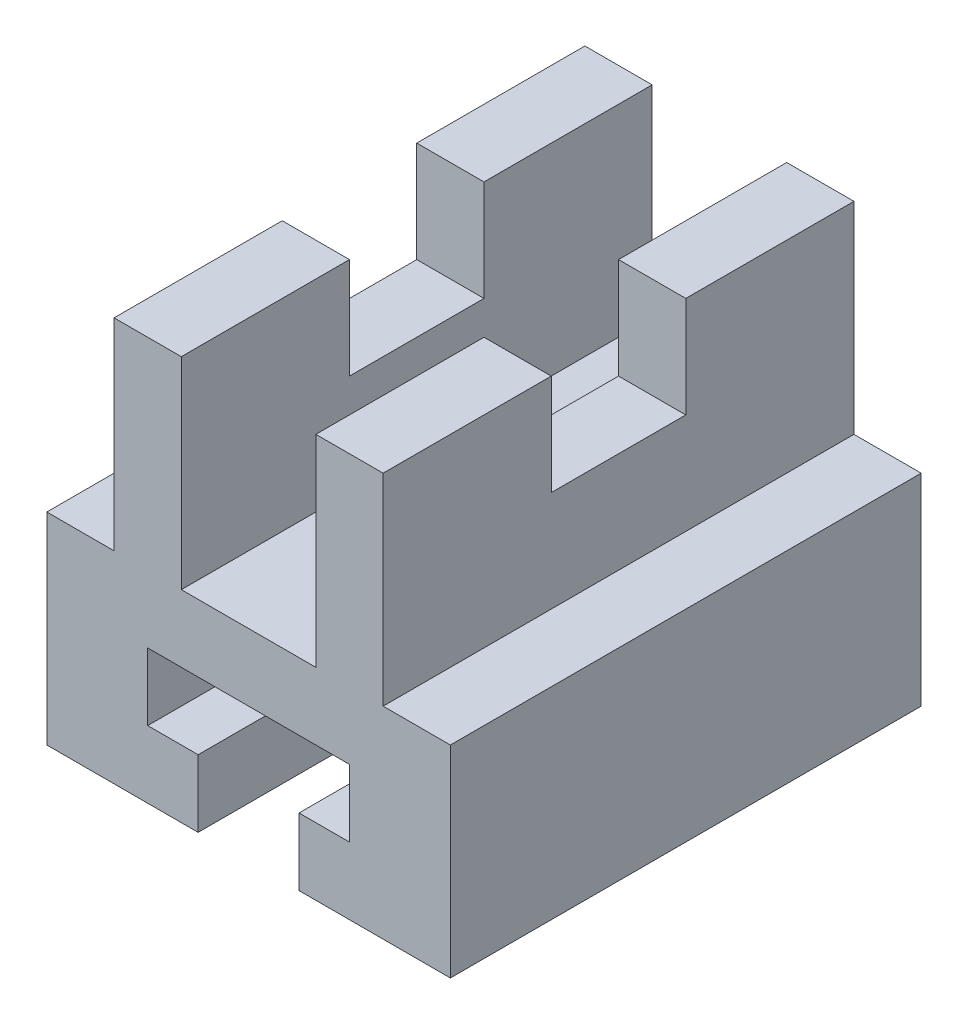
ISO-10303-21;
HEADER;
FILE_DESCRIPTION(('STEP AP214'),'2;1');
FILE_NAME('part.step','',(''),(''),'','','');
FILE_SCHEMA(('AUTOMOTIVE_DESIGN { 1 0 10303 214 1 1 1 1 }'));
ENDSEC;
DATA;
#1=APPLICATION_CONTEXT('core data for automotive mechanical design processes');
#2=APPLICATION_PROTOCOL_DEFINITION('international standard','automotive_design',2000,#1);
#3=PRODUCT_CONTEXT('',#1,'mechanical');
#4=PRODUCT('Part','Part','',(#3));
#5=PRODUCT_RELATED_PRODUCT_CATEGORY('part','',(#4));
#6=PRODUCT_DEFINITION_FORMATION('','',#4);
#7=PRODUCT_DEFINITION_CONTEXT('part definition',#1,'design');
#8=PRODUCT_DEFINITION('design','',#6,#7);
#9=PRODUCT_DEFINITION_SHAPE('','',#8);
#10=(LENGTH_UNIT() NAMED_UNIT(*) SI_UNIT(.MILLI.,.METRE.));
#11=(NAMED_UNIT(*) PLANE_ANGLE_UNIT() SI_UNIT($,.RADIAN.));
#12=(NAMED_UNIT(*) SI_UNIT($,.STERADIAN.) SOLID_ANGLE_UNIT());
#13=UNCERTAINTY_MEASURE_WITH_UNIT(LENGTH_MEASURE(1.E-05),#10,'distance_accuracy_value','');
#14=(GEOMETRIC_REPRESENTATION_CONTEXT(3) GLOBAL_UNCERTAINTY_ASSIGNED_CONTEXT((#13)) GLOBAL_UNIT_ASSIGNED_CONTEXT((#10,
#11,#12)) REPRESENTATION_CONTEXT('',''));
#15=CARTESIAN_POINT('',(0.,0.,0.));
#16=DIRECTION('',(0.,0.,1.));
#17=DIRECTION('',(1.,0.,0.));
#18=AXIS2_PLACEMENT_3D('',#15,#16,#17);
#19=CARTESIAN_POINT('',(-35.6353607965203,25.3072625698324,70.));
#20=DIRECTION('',(0.,-1.,0.));
#21=DIRECTION('',(1.,0.,0.));
#22=AXIS2_PLACEMENT_3D('',#19,#20,#21);
#23=PLANE('',#22);
#24=DIRECTION('',(0.,0.,1.));
#25=VECTOR('',#24,1.);
#26=CARTESIAN_POINT('',(14.3646392034797,25.3072625698324,0.));
#27=LINE('',#26,#25);
#28=CARTESIAN_POINT('',(14.3646392034797,25.3072625698324,45.));
#29=VERTEX_POINT('',#28);
#30=CARTESIAN_POINT('',(14.3646392034797,25.3072625698324,70.));
#31=VERTEX_POINT('',#30);
#32=EDGE_CURVE('E242',#29,#31,#27,.T.);
#33=ORIENTED_EDGE('',*,*,#32,.F.);
#34=DIRECTION('',(-1.,0.,0.));
#35=VECTOR('',#34,1.);
#36=CARTESIAN_POINT('',(14.3646392034797,25.3072625698324,45.));
#37=LINE('',#36,#35);
#38=CARTESIAN_POINT('',(4.36463920347973,25.3072625698324,45.));
#39=VERTEX_POINT('',#38);
#40=EDGE_CURVE('E360',#29,#39,#37,.T.);
#41=ORIENTED_EDGE('',*,*,#40,.T.);
#42=DIRECTION('',(0.,0.,1.));
#43=VECTOR('',#42,1.);
#44=CARTESIAN_POINT('',(4.36463920347973,25.3072625698324,0.));
#45=LINE('',#44,#43);
#46=CARTESIAN_POINT('',(4.36463920347973,25.3072625698324,70.));
#47=VERTEX_POINT('',#46);
#48=EDGE_CURVE('E392',#39,#47,#45,.T.);
#49=ORIENTED_EDGE('',*,*,#48,.T.);
#50=DIRECTION('',(-1.,0.,0.));
#51=VECTOR('',#50,1.);
#52=CARTESIAN_POINT('',(-35.6353607965203,25.3072625698324,70.));
#53=LINE('',#52,#51);
#54=EDGE_CURVE('E319',#31,#47,#53,.T.);
#55=ORIENTED_EDGE('',*,*,#54,.F.);
#56=EDGE_LOOP('',(#33,#41,#49,#55));
#57=FACE_BOUND('',#56,.T.);
#58=ADVANCED_FACE('F33',(#57),#23,.F.);
#59=DIRECTION('',(0.,0.,1.));
#60=VECTOR('',#59,1.);
#61=CARTESIAN_POINT('',(-15.6353607965203,25.3072625698324,0.));
#62=LINE('',#61,#60);
#63=CARTESIAN_POINT('',(-15.6353607965203,25.3072625698324,45.));
#64=VERTEX_POINT('',#63);
#65=CARTESIAN_POINT('',(-15.6353607965203,25.3072625698324,70.));
#66=VERTEX_POINT('',#65);
#67=EDGE_CURVE('E382',#64,#66,#62,.T.);
#68=ORIENTED_EDGE('',*,*,#67,.F.);
#69=CARTESIAN_POINT('',(-25.6353607965203,25.3072625698324,45.));
#70=VERTEX_POINT('',#69);
#71=EDGE_CURVE('E357',#64,#70,#37,.T.);
#72=ORIENTED_EDGE('',*,*,#71,.T.);
#73=DIRECTION('',(0.,0.,1.));
#74=VECTOR('',#73,1.);
#75=CARTESIAN_POINT('',(-25.6353607965203,25.3072625698324,0.));
#76=LINE('',#75,#74);
#77=CARTESIAN_POINT('',(-25.6353607965203,25.3072625698324,70.));
#78=VERTEX_POINT('',#77);
#79=EDGE_CURVE('E415',#70,#78,#76,.T.);
#80=ORIENTED_EDGE('',*,*,#79,.T.);
#81=EDGE_CURVE('E318',#66,#78,#53,.T.);
#82=ORIENTED_EDGE('',*,*,#81,.F.);
#83=EDGE_LOOP('',(#68,#72,#80,#82));
#84=FACE_BOUND('',#83,.T.);
#85=ADVANCED_FACE('F465',(#84),#23,.F.);
#86=CARTESIAN_POINT('',(4.36463920347973,25.3072625698324,0.));
#87=VERTEX_POINT('',#86);
#88=CARTESIAN_POINT('',(4.36463920347973,25.3072625698324,25.));
#89=VERTEX_POINT('',#88);
#90=EDGE_CURVE('E234',#87,#89,#45,.T.);
#91=ORIENTED_EDGE('',*,*,#90,.T.);
#92=DIRECTION('',(-1.,0.,0.));
#93=VECTOR('',#92,1.);
#94=CARTESIAN_POINT('',(14.3646392034797,25.3072625698324,25.));
#95=LINE('',#94,#93);
#96=CARTESIAN_POINT('',(14.3646392034797,25.3072625698324,25.));
#97=VERTEX_POINT('',#96);
#98=EDGE_CURVE('E48',#97,#89,#95,.T.);
#99=ORIENTED_EDGE('',*,*,#98,.F.);
#100=CARTESIAN_POINT('',(14.3646392034797,25.3072625698324,0.));
#101=VERTEX_POINT('',#100);
#102=EDGE_CURVE('E232',#101,#97,#27,.T.);
#103=ORIENTED_EDGE('',*,*,#102,.F.);
#104=DIRECTION('',(-1.,0.,0.));
#105=VECTOR('',#104,1.);
#106=CARTESIAN_POINT('',(-35.6353607965203,25.3072625698324,0.));
#107=LINE('',#106,#105);
#108=EDGE_CURVE('E311',#101,#87,#107,.T.);
#109=ORIENTED_EDGE('',*,*,#108,.T.);
#110=EDGE_LOOP('',(#91,#99,#103,#109));
#111=FACE_BOUND('',#110,.T.);
#112=ADVANCED_FACE('F230',(#111),#23,.F.);
#113=CARTESIAN_POINT('',(-35.6353607965203,-34.6927374301676,70.));
#114=DIRECTION('',(0.,1.,0.));
#115=DIRECTION('',(0.,0.,1.));
#116=AXIS2_PLACEMENT_3D('',#113,#114,#115);
#117=PLANE('',#116);
#118=DIRECTION('',(1.,0.,0.));
#119=VECTOR('',#118,1.);
#120=CARTESIAN_POINT('',(-35.6353607965203,-34.6927374301676,0.));
#121=LINE('',#120,#119);
#122=CARTESIAN_POINT('',(-35.6353607965203,-34.6927374301676,0.));
#123=VERTEX_POINT('',#122);
#124=CARTESIAN_POINT('',(-13.1353607965203,-34.6927374301676,0.));
#125=VERTEX_POINT('',#124);
#126=EDGE_CURVE('E325',#123,#125,#121,.T.);
#127=ORIENTED_EDGE('',*,*,#126,.T.);
#128=DIRECTION('',(0.,0.,1.));
#129=VECTOR('',#128,1.);
#130=CARTESIAN_POINT('',(-13.1353607965203,-34.6927374301676,0.));
#131=LINE('',#130,#129);
#132=CARTESIAN_POINT('',(-13.1353607965203,-34.6927374301676,70.));
#133=VERTEX_POINT('',#132);
#134=EDGE_CURVE('E291',#125,#133,#131,.T.);
#135=ORIENTED_EDGE('',*,*,#134,.T.);
#136=DIRECTION('',(1.,0.,0.));
#137=VECTOR('',#136,1.);
#138=CARTESIAN_POINT('',(-35.6353607965203,-34.6927374301676,70.));
#139=LINE('',#138,#137);
#140=CARTESIAN_POINT('',(-35.6353607965203,-34.6927374301676,70.));
#141=VERTEX_POINT('',#140);
#142=EDGE_CURVE('E312',#141,#133,#139,.T.);
#143=ORIENTED_EDGE('',*,*,#142,.F.);
#144=DIRECTION('',(0.,0.,-1.));
#145=VECTOR('',#144,1.);
#146=CARTESIAN_POINT('',(-35.6353607965203,-34.6927374301676,70.));
#147=LINE('',#146,#145);
#148=EDGE_CURVE('E335',#141,#123,#147,.T.);
#149=ORIENTED_EDGE('',*,*,#148,.T.);
#150=EDGE_LOOP('',(#127,#135,#143,#149));
#151=FACE_BOUND('',#150,.T.);
#152=ADVANCED_FACE('F483',(#151),#117,.F.);
#153=CARTESIAN_POINT('',(-35.6353607965203,25.3072625698324,70.));
#154=DIRECTION('',(1.,0.,0.));
#155=DIRECTION('',(0.,0.,-1.));
#156=AXIS2_PLACEMENT_3D('',#153,#154,#155);
#157=PLANE('',#156);
#158=DIRECTION('',(0.,-1.,0.));
#159=VECTOR('',#158,1.);
#160=CARTESIAN_POINT('',(-35.6353607965203,25.3072625698324,70.));
#161=LINE('',#160,#159);
#162=CARTESIAN_POINT('',(-35.6353607965203,-4.69273743016759,70.));
#163=VERTEX_POINT('',#162);
#164=EDGE_CURVE('E308',#163,#141,#161,.T.);
#165=ORIENTED_EDGE('',*,*,#164,.F.);
#166=DIRECTION('',(0.,0.,1.));
#167=VECTOR('',#166,1.);
#168=CARTESIAN_POINT('',(-35.6353607965203,-4.69273743016759,0.));
#169=LINE('',#168,#167);
#170=CARTESIAN_POINT('',(-35.6353607965203,-4.69273743016759,0.));
#171=VERTEX_POINT('',#170);
#172=EDGE_CURVE('E406',#171,#163,#169,.T.);
#173=ORIENTED_EDGE('',*,*,#172,.F.);
#174=DIRECTION('',(0.,-1.,0.));
#175=VECTOR('',#174,1.);
#176=CARTESIAN_POINT('',(-35.6353607965203,25.3072625698324,0.));
#177=LINE('',#176,#175);
#178=EDGE_CURVE('E294',#171,#123,#177,.T.);
#179=ORIENTED_EDGE('',*,*,#178,.T.);
#180=ORIENTED_EDGE('',*,*,#148,.F.);
#181=EDGE_LOOP('',(#165,#173,#179,#180));
#182=FACE_BOUND('',#181,.T.);
#183=ADVANCED_FACE('F35',(#182),#157,.F.);
#184=CARTESIAN_POINT('',(1.86463920347972,-34.6927374301676,70.));
#185=VERTEX_POINT('',#184);
#186=CARTESIAN_POINT('',(24.3646392034797,-34.6927374301676,70.));
#187=VERTEX_POINT('',#186);
#188=EDGE_CURVE('E310',#185,#187,#139,.T.);
#189=ORIENTED_EDGE('',*,*,#188,.F.);
#190=DIRECTION('',(0.,0.,1.));
#191=VECTOR('',#190,1.);
#192=CARTESIAN_POINT('',(1.86463920347972,-34.6927374301676,0.));
#193=LINE('',#192,#191);
#194=CARTESIAN_POINT('',(1.86463920347972,-34.6927374301676,0.));
#195=VERTEX_POINT('',#194);
#196=EDGE_CURVE('E271',#195,#185,#193,.T.);
#197=ORIENTED_EDGE('',*,*,#196,.F.);
#198=CARTESIAN_POINT('',(24.3646392034797,-34.6927374301676,0.));
#199=VERTEX_POINT('',#198);
#200=EDGE_CURVE('E324',#195,#199,#121,.T.);
#201=ORIENTED_EDGE('',*,*,#200,.T.);
#202=DIRECTION('',(0.,0.,-1.));
#203=VECTOR('',#202,1.);
#204=CARTESIAN_POINT('',(24.3646392034797,-34.6927374301676,70.));
#205=LINE('',#204,#203);
#206=EDGE_CURVE('E322',#187,#199,#205,.T.);
#207=ORIENTED_EDGE('',*,*,#206,.F.);
#208=EDGE_LOOP('',(#189,#197,#201,#207));
#209=FACE_BOUND('',#208,.T.);
#210=ADVANCED_FACE('F442',(#209),#117,.F.);
#211=CARTESIAN_POINT('',(24.3646392034797,25.3072625698324,70.));
#212=DIRECTION('',(-1.,0.,0.));
#213=DIRECTION('',(0.,0.,1.));
#214=AXIS2_PLACEMENT_3D('',#211,#212,#213);
#215=PLANE('',#214);
#216=DIRECTION('',(0.,1.,0.));
#217=VECTOR('',#216,1.);
#218=CARTESIAN_POINT('',(24.3646392034797,25.3072625698324,0.));
#219=LINE('',#218,#217);
#220=CARTESIAN_POINT('',(24.3646392034797,-4.69273743016759,0.));
#221=VERTEX_POINT('',#220);
#222=EDGE_CURVE('E328',#199,#221,#219,.T.);
#223=ORIENTED_EDGE('',*,*,#222,.T.);
#224=DIRECTION('',(0.,0.,1.));
#225=VECTOR('',#224,1.);
#226=CARTESIAN_POINT('',(24.3646392034797,-4.69273743016759,0.));
#227=LINE('',#226,#225);
#228=CARTESIAN_POINT('',(24.3646392034797,-4.69273743016759,70.));
#229=VERTEX_POINT('',#228);
#230=EDGE_CURVE('E244',#221,#229,#227,.T.);
#231=ORIENTED_EDGE('',*,*,#230,.T.);
#232=DIRECTION('',(0.,1.,0.));
#233=VECTOR('',#232,1.);
#234=CARTESIAN_POINT('',(24.3646392034797,25.3072625698324,70.));
#235=LINE('',#234,#233);
#236=EDGE_CURVE('E315',#187,#229,#235,.T.);
#237=ORIENTED_EDGE('',*,*,#236,.F.);
#238=ORIENTED_EDGE('',*,*,#206,.T.);
#239=EDGE_LOOP('',(#223,#231,#237,#238));
#240=FACE_BOUND('',#239,.T.);
#241=ADVANCED_FACE('F428',(#240),#215,.F.);
#242=CARTESIAN_POINT('',(-25.6353607965203,25.3072625698324,0.));
#243=VERTEX_POINT('',#242);
#244=CARTESIAN_POINT('',(-25.6353607965203,25.3072625698324,25.));
#245=VERTEX_POINT('',#244);
#246=EDGE_CURVE('E411',#243,#245,#76,.T.);
#247=ORIENTED_EDGE('',*,*,#246,.T.);
#248=CARTESIAN_POINT('',(-15.6353607965203,25.3072625698324,25.));
#249=VERTEX_POINT('',#248);
#250=EDGE_CURVE('E235',#249,#245,#95,.T.);
#251=ORIENTED_EDGE('',*,*,#250,.F.);
#252=CARTESIAN_POINT('',(-15.6353607965203,25.3072625698324,0.));
#253=VERTEX_POINT('',#252);
#254=EDGE_CURVE('E397',#253,#249,#62,.T.);
#255=ORIENTED_EDGE('',*,*,#254,.F.);
#256=EDGE_CURVE('E331',#253,#243,#107,.T.);
#257=ORIENTED_EDGE('',*,*,#256,.T.);
#258=EDGE_LOOP('',(#247,#251,#255,#257));
#259=FACE_BOUND('',#258,.T.);
#260=ADVANCED_FACE('F512',(#259),#23,.F.);
#261=CARTESIAN_POINT('',(0.,0.,70.));
#262=DIRECTION('',(0.,0.,1.));
#263=DIRECTION('',(1.,0.,0.));
#264=AXIS2_PLACEMENT_3D('',#261,#262,#263);
#265=PLANE('',#264);
#266=DIRECTION('',(0.,1.,0.));
#267=VECTOR('',#266,1.);
#268=CARTESIAN_POINT('',(4.36463920347973,-4.6927374301676,70.));
#269=LINE('',#268,#267);
#270=CARTESIAN_POINT('',(4.36463920347973,-4.6927374301676,70.));
#271=VERTEX_POINT('',#270);
#272=EDGE_CURVE('E376',#271,#47,#269,.T.);
#273=ORIENTED_EDGE('',*,*,#272,.F.);
#274=DIRECTION('',(1.,0.,0.));
#275=VECTOR('',#274,1.);
#276=CARTESIAN_POINT('',(-15.6353607965203,-4.6927374301676,70.));
#277=LINE('',#276,#275);
#278=CARTESIAN_POINT('',(-15.6353607965203,-4.6927374301676,70.));
#279=VERTEX_POINT('',#278);
#280=EDGE_CURVE('E385',#279,#271,#277,.T.);
#281=ORIENTED_EDGE('',*,*,#280,.F.);
#282=DIRECTION('',(0.,-1.,0.));
#283=VECTOR('',#282,1.);
#284=CARTESIAN_POINT('',(-15.6353607965203,25.3072625698324,70.));
#285=LINE('',#284,#283);
#286=EDGE_CURVE('E371',#66,#279,#285,.T.);
#287=ORIENTED_EDGE('',*,*,#286,.F.);
#288=ORIENTED_EDGE('',*,*,#81,.T.);
#289=DIRECTION('',(0.,1.,0.));
#290=VECTOR('',#289,1.);
#291=CARTESIAN_POINT('',(-25.6353607965203,-4.69273743016759,70.));
#292=LINE('',#291,#290);
#293=CARTESIAN_POINT('',(-25.6353607965203,-4.69273743016759,70.));
#294=VERTEX_POINT('',#293);
#295=EDGE_CURVE('E403',#294,#78,#292,.T.);
#296=ORIENTED_EDGE('',*,*,#295,.F.);
#297=DIRECTION('',(1.,0.,0.));
#298=VECTOR('',#297,1.);
#299=CARTESIAN_POINT('',(-35.6353607965203,-4.69273743016759,70.));
#300=LINE('',#299,#298);
#301=EDGE_CURVE('E391',#163,#294,#300,.T.);
#302=ORIENTED_EDGE('',*,*,#301,.F.);
#303=ORIENTED_EDGE('',*,*,#164,.T.);
#304=ORIENTED_EDGE('',*,*,#142,.T.);
#305=DIRECTION('',(0.,-1.,0.));
#306=VECTOR('',#305,1.);
#307=CARTESIAN_POINT('',(-13.1353607965203,-34.6927374301676,70.));
#308=LINE('',#307,#306);
#309=CARTESIAN_POINT('',(-13.1353607965203,-24.6927374301676,70.));
#310=VERTEX_POINT('',#309);
#311=EDGE_CURVE('E253',#310,#133,#308,.T.);
#312=ORIENTED_EDGE('',*,*,#311,.F.);
#313=DIRECTION('',(1.,0.,0.));
#314=VECTOR('',#313,1.);
#315=CARTESIAN_POINT('',(-13.1353607965203,-24.6927374301676,70.));
#316=LINE('',#315,#314);
#317=CARTESIAN_POINT('',(-20.6353607965203,-24.6927374301676,70.));
#318=VERTEX_POINT('',#317);
#319=EDGE_CURVE('E287',#318,#310,#316,.T.);
#320=ORIENTED_EDGE('',*,*,#319,.F.);
#321=DIRECTION('',(0.,-1.,0.));
#322=VECTOR('',#321,1.);
#323=CARTESIAN_POINT('',(-20.6353607965203,-24.6927374301676,70.));
#324=LINE('',#323,#322);
#325=CARTESIAN_POINT('',(-20.6353607965203,-14.6927374301676,70.));
#326=VERTEX_POINT('',#325);
#327=EDGE_CURVE('E284',#326,#318,#324,.T.);
#328=ORIENTED_EDGE('',*,*,#327,.F.);
#329=DIRECTION('',(-1.,0.,0.));
#330=VECTOR('',#329,1.);
#331=CARTESIAN_POINT('',(-20.6353607965203,-14.6927374301676,70.));
#332=LINE('',#331,#330);
#333=CARTESIAN_POINT('',(9.36463920347972,-14.6927374301676,70.));
#334=VERTEX_POINT('',#333);
#335=EDGE_CURVE('E281',#334,#326,#332,.T.);
#336=ORIENTED_EDGE('',*,*,#335,.F.);
#337=DIRECTION('',(0.,1.,0.));
#338=VECTOR('',#337,1.);
#339=CARTESIAN_POINT('',(9.36463920347972,-14.6927374301676,70.));
#340=LINE('',#339,#338);
#341=CARTESIAN_POINT('',(9.36463920347972,-24.6927374301676,70.));
#342=VERTEX_POINT('',#341);
#343=EDGE_CURVE('E278',#342,#334,#340,.T.);
#344=ORIENTED_EDGE('',*,*,#343,.F.);
#345=DIRECTION('',(1.,0.,0.));
#346=VECTOR('',#345,1.);
#347=CARTESIAN_POINT('',(9.36463920347972,-24.6927374301676,70.));
#348=LINE('',#347,#346);
#349=CARTESIAN_POINT('',(1.86463920347972,-24.6927374301676,70.));
#350=VERTEX_POINT('',#349);
#351=EDGE_CURVE('E275',#350,#342,#348,.T.);
#352=ORIENTED_EDGE('',*,*,#351,.F.);
#353=DIRECTION('',(0.,1.,0.));
#354=VECTOR('',#353,1.);
#355=CARTESIAN_POINT('',(1.86463920347972,-24.6927374301676,70.));
#356=LINE('',#355,#354);
#357=EDGE_CURVE('E272',#185,#350,#356,.T.);
#358=ORIENTED_EDGE('',*,*,#357,.F.);
#359=ORIENTED_EDGE('',*,*,#188,.T.);
#360=ORIENTED_EDGE('',*,*,#236,.T.);
#361=DIRECTION('',(1.,0.,0.));
#362=VECTOR('',#361,1.);
#363=CARTESIAN_POINT('',(24.3646392034797,-4.69273743016759,70.));
#364=LINE('',#363,#362);
#365=CARTESIAN_POINT('',(14.3646392034797,-4.69273743016759,70.));
#366=VERTEX_POINT('',#365);
#367=EDGE_CURVE('E420',#366,#229,#364,.T.);
#368=ORIENTED_EDGE('',*,*,#367,.F.);
#369=DIRECTION('',(0.,-1.,0.));
#370=VECTOR('',#369,1.);
#371=CARTESIAN_POINT('',(14.3646392034797,-4.69273743016759,70.));
#372=LINE('',#371,#370);
#373=EDGE_CURVE('E414',#31,#366,#372,.T.);
#374=ORIENTED_EDGE('',*,*,#373,.F.);
#375=ORIENTED_EDGE('',*,*,#54,.T.);
#376=EDGE_LOOP('',(#273,#281,#287,#288,#296,#302,#303,#304,#312,#320,#328,#336,#344,#352,#358,
#359,#360,#368,#374,#375));
#377=FACE_BOUND('',#376,.T.);
#378=ADVANCED_FACE('F434',(#377),#265,.T.);
#379=CARTESIAN_POINT('',(0.,0.,0.));
#380=DIRECTION('',(0.,0.,1.));
#381=DIRECTION('',(1.,0.,0.));
#382=AXIS2_PLACEMENT_3D('',#379,#380,#381);
#383=PLANE('',#382);
#384=DIRECTION('',(1.,0.,0.));
#385=VECTOR('',#384,1.);
#386=CARTESIAN_POINT('',(-15.6353607965203,-4.6927374301676,0.));
#387=LINE('',#386,#385);
#388=CARTESIAN_POINT('',(-15.6353607965203,-4.6927374301676,0.));
#389=VERTEX_POINT('',#388);
#390=CARTESIAN_POINT('',(4.36463920347973,-4.6927374301676,0.));
#391=VERTEX_POINT('',#390);
#392=EDGE_CURVE('E375',#389,#391,#387,.T.);
#393=ORIENTED_EDGE('',*,*,#392,.T.);
#394=DIRECTION('',(0.,1.,0.));
#395=VECTOR('',#394,1.);
#396=CARTESIAN_POINT('',(4.36463920347973,-4.6927374301676,0.));
#397=LINE('',#396,#395);
#398=EDGE_CURVE('E379',#391,#87,#397,.T.);
#399=ORIENTED_EDGE('',*,*,#398,.T.);
#400=ORIENTED_EDGE('',*,*,#108,.F.);
#401=DIRECTION('',(0.,-1.,0.));
#402=VECTOR('',#401,1.);
#403=CARTESIAN_POINT('',(14.3646392034797,-4.69273743016759,0.));
#404=LINE('',#403,#402);
#405=CARTESIAN_POINT('',(14.3646392034797,-4.69273743016759,0.));
#406=VERTEX_POINT('',#405);
#407=EDGE_CURVE('E240',#101,#406,#404,.T.);
#408=ORIENTED_EDGE('',*,*,#407,.T.);
#409=DIRECTION('',(1.,0.,0.));
#410=VECTOR('',#409,1.);
#411=CARTESIAN_POINT('',(24.3646392034797,-4.69273743016759,0.));
#412=LINE('',#411,#410);
#413=EDGE_CURVE('E246',#406,#221,#412,.T.);
#414=ORIENTED_EDGE('',*,*,#413,.T.);
#415=ORIENTED_EDGE('',*,*,#222,.F.);
#416=ORIENTED_EDGE('',*,*,#200,.F.);
#417=DIRECTION('',(0.,1.,0.));
#418=VECTOR('',#417,1.);
#419=CARTESIAN_POINT('',(1.86463920347972,-24.6927374301676,0.));
#420=LINE('',#419,#418);
#421=CARTESIAN_POINT('',(1.86463920347972,-24.6927374301676,0.));
#422=VERTEX_POINT('',#421);
#423=EDGE_CURVE('E249',#195,#422,#420,.T.);
#424=ORIENTED_EDGE('',*,*,#423,.T.);
#425=DIRECTION('',(1.,0.,0.));
#426=VECTOR('',#425,1.);
#427=CARTESIAN_POINT('',(9.36463920347972,-24.6927374301676,0.));
#428=LINE('',#427,#426);
#429=CARTESIAN_POINT('',(9.36463920347972,-24.6927374301676,0.));
#430=VERTEX_POINT('',#429);
#431=EDGE_CURVE('E252',#422,#430,#428,.T.);
#432=ORIENTED_EDGE('',*,*,#431,.T.);
#433=DIRECTION('',(0.,1.,0.));
#434=VECTOR('',#433,1.);
#435=CARTESIAN_POINT('',(9.36463920347972,-14.6927374301676,0.));
#436=LINE('',#435,#434);
#437=CARTESIAN_POINT('',(9.36463920347972,-14.6927374301676,0.));
#438=VERTEX_POINT('',#437);
#439=EDGE_CURVE('E256',#430,#438,#436,.T.);
#440=ORIENTED_EDGE('',*,*,#439,.T.);
#441=DIRECTION('',(-1.,0.,0.));
#442=VECTOR('',#441,1.);
#443=CARTESIAN_POINT('',(-20.6353607965203,-14.6927374301676,0.));
#444=LINE('',#443,#442);
#445=CARTESIAN_POINT('',(-20.6353607965203,-14.6927374301676,0.));
#446=VERTEX_POINT('',#445);
#447=EDGE_CURVE('E259',#438,#446,#444,.T.);
#448=ORIENTED_EDGE('',*,*,#447,.T.);
#449=DIRECTION('',(0.,-1.,0.));
#450=VECTOR('',#449,1.);
#451=CARTESIAN_POINT('',(-20.6353607965203,-24.6927374301676,0.));
#452=LINE('',#451,#450);
#453=CARTESIAN_POINT('',(-20.6353607965203,-24.6927374301676,0.));
#454=VERTEX_POINT('',#453);
#455=EDGE_CURVE('E262',#446,#454,#452,.T.);
#456=ORIENTED_EDGE('',*,*,#455,.T.);
#457=DIRECTION('',(1.,0.,0.));
#458=VECTOR('',#457,1.);
#459=CARTESIAN_POINT('',(-13.1353607965203,-24.6927374301676,0.));
#460=LINE('',#459,#458);
#461=CARTESIAN_POINT('',(-13.1353607965203,-24.6927374301676,0.));
#462=VERTEX_POINT('',#461);
#463=EDGE_CURVE('E265',#454,#462,#460,.T.);
#464=ORIENTED_EDGE('',*,*,#463,.T.);
#465=DIRECTION('',(0.,-1.,0.));
#466=VECTOR('',#465,1.);
#467=CARTESIAN_POINT('',(-13.1353607965203,-34.6927374301676,0.));
#468=LINE('',#467,#466);
#469=EDGE_CURVE('E268',#462,#125,#468,.T.);
#470=ORIENTED_EDGE('',*,*,#469,.T.);
#471=ORIENTED_EDGE('',*,*,#126,.F.);
#472=ORIENTED_EDGE('',*,*,#178,.F.);
#473=DIRECTION('',(1.,0.,0.));
#474=VECTOR('',#473,1.);
#475=CARTESIAN_POINT('',(-35.6353607965203,-4.69273743016759,0.));
#476=LINE('',#475,#474);
#477=CARTESIAN_POINT('',(-25.6353607965203,-4.69273743016759,0.));
#478=VERTEX_POINT('',#477);
#479=EDGE_CURVE('E399',#171,#478,#476,.T.);
#480=ORIENTED_EDGE('',*,*,#479,.T.);
#481=DIRECTION('',(0.,1.,0.));
#482=VECTOR('',#481,1.);
#483=CARTESIAN_POINT('',(-25.6353607965203,-4.69273743016759,0.));
#484=LINE('',#483,#482);
#485=EDGE_CURVE('E402',#478,#243,#484,.T.);
#486=ORIENTED_EDGE('',*,*,#485,.T.);
#487=ORIENTED_EDGE('',*,*,#256,.F.);
#488=DIRECTION('',(0.,-1.,0.));
#489=VECTOR('',#488,1.);
#490=CARTESIAN_POINT('',(-15.6353607965203,25.3072625698324,0.));
#491=LINE('',#490,#489);
#492=EDGE_CURVE('E372',#253,#389,#491,.T.);
#493=ORIENTED_EDGE('',*,*,#492,.T.);
#494=EDGE_LOOP('',(#393,#399,#400,#408,#414,#415,#416,#424,#432,#440,#448,#456,#464,#470,#471,
#472,#480,#486,#487,#493));
#495=FACE_BOUND('',#494,.T.);
#496=ADVANCED_FACE('F445',(#495),#383,.F.);
#497=CARTESIAN_POINT('',(-13.1353607965203,-34.6927374301676,0.));
#498=DIRECTION('',(-1.,0.,0.));
#499=DIRECTION('',(0.,0.,1.));
#500=AXIS2_PLACEMENT_3D('',#497,#498,#499);
#501=PLANE('',#500);
#502=ORIENTED_EDGE('',*,*,#311,.T.);
#503=ORIENTED_EDGE('',*,*,#134,.F.);
#504=ORIENTED_EDGE('',*,*,#469,.F.);
#505=DIRECTION('',(0.,0.,1.));
#506=VECTOR('',#505,1.);
#507=CARTESIAN_POINT('',(-13.1353607965203,-24.6927374301676,0.));
#508=LINE('',#507,#506);
#509=EDGE_CURVE('E295',#462,#310,#508,.T.);
#510=ORIENTED_EDGE('',*,*,#509,.T.);
#511=EDGE_LOOP('',(#502,#503,#504,#510));
#512=FACE_BOUND('',#511,.T.);
#513=ADVANCED_FACE('F488',(#512),#501,.F.);
#514=CARTESIAN_POINT('',(-13.1353607965203,-24.6927374301676,0.));
#515=DIRECTION('',(0.,-1.,0.));
#516=DIRECTION('',(0.,0.,-1.));
#517=AXIS2_PLACEMENT_3D('',#514,#515,#516);
#518=PLANE('',#517);
#519=ORIENTED_EDGE('',*,*,#319,.T.);
#520=ORIENTED_EDGE('',*,*,#509,.F.);
#521=ORIENTED_EDGE('',*,*,#463,.F.);
#522=DIRECTION('',(0.,0.,1.));
#523=VECTOR('',#522,1.);
#524=CARTESIAN_POINT('',(-20.6353607965203,-24.6927374301676,0.));
#525=LINE('',#524,#523);
#526=EDGE_CURVE('E297',#454,#318,#525,.T.);
#527=ORIENTED_EDGE('',*,*,#526,.T.);
#528=EDGE_LOOP('',(#519,#520,#521,#527));
#529=FACE_BOUND('',#528,.T.);
#530=ADVANCED_FACE('F492',(#529),#518,.F.);
#531=CARTESIAN_POINT('',(-20.6353607965203,-24.6927374301676,0.));
#532=DIRECTION('',(-1.,0.,0.));
#533=DIRECTION('',(0.,0.,1.));
#534=AXIS2_PLACEMENT_3D('',#531,#532,#533);
#535=PLANE('',#534);
#536=ORIENTED_EDGE('',*,*,#327,.T.);
#537=ORIENTED_EDGE('',*,*,#526,.F.);
#538=ORIENTED_EDGE('',*,*,#455,.F.);
#539=DIRECTION('',(0.,0.,1.));
#540=VECTOR('',#539,1.);
#541=CARTESIAN_POINT('',(-20.6353607965203,-14.6927374301676,0.));
#542=LINE('',#541,#540);
#543=EDGE_CURVE('E299',#446,#326,#542,.T.);
#544=ORIENTED_EDGE('',*,*,#543,.T.);
#545=EDGE_LOOP('',(#536,#537,#538,#544));
#546=FACE_BOUND('',#545,.T.);
#547=ADVANCED_FACE('F495',(#546),#535,.F.);
#548=CARTESIAN_POINT('',(-20.6353607965203,-14.6927374301676,0.));
#549=DIRECTION('',(0.,1.,0.));
#550=DIRECTION('',(0.,0.,1.));
#551=AXIS2_PLACEMENT_3D('',#548,#549,#550);
#552=PLANE('',#551);
#553=ORIENTED_EDGE('',*,*,#335,.T.);
#554=ORIENTED_EDGE('',*,*,#543,.F.);
#555=ORIENTED_EDGE('',*,*,#447,.F.);
#556=DIRECTION('',(0.,0.,1.));
#557=VECTOR('',#556,1.);
#558=CARTESIAN_POINT('',(9.36463920347972,-14.6927374301676,0.));
#559=LINE('',#558,#557);
#560=EDGE_CURVE('E301',#438,#334,#559,.T.);
#561=ORIENTED_EDGE('',*,*,#560,.T.);
#562=EDGE_LOOP('',(#553,#554,#555,#561));
#563=FACE_BOUND('',#562,.T.);
#564=ADVANCED_FACE('F499',(#563),#552,.F.);
#565=CARTESIAN_POINT('',(9.36463920347972,-14.6927374301676,0.));
#566=DIRECTION('',(1.,0.,0.));
#567=DIRECTION('',(0.,0.,-1.));
#568=AXIS2_PLACEMENT_3D('',#565,#566,#567);
#569=PLANE('',#568);
#570=ORIENTED_EDGE('',*,*,#343,.T.);
#571=ORIENTED_EDGE('',*,*,#560,.F.);
#572=ORIENTED_EDGE('',*,*,#439,.F.);
#573=DIRECTION('',(0.,0.,1.));
#574=VECTOR('',#573,1.);
#575=CARTESIAN_POINT('',(9.36463920347972,-24.6927374301676,0.));
#576=LINE('',#575,#574);
#577=EDGE_CURVE('E303',#430,#342,#576,.T.);
#578=ORIENTED_EDGE('',*,*,#577,.T.);
#579=EDGE_LOOP('',(#570,#571,#572,#578));
#580=FACE_BOUND('',#579,.T.);
#581=ADVANCED_FACE('F503',(#580),#569,.F.);
#582=CARTESIAN_POINT('',(9.36463920347972,-24.6927374301676,0.));
#583=DIRECTION('',(0.,-1.,0.));
#584=DIRECTION('',(0.,0.,-1.));
#585=AXIS2_PLACEMENT_3D('',#582,#583,#584);
#586=PLANE('',#585);
#587=ORIENTED_EDGE('',*,*,#351,.T.);
#588=ORIENTED_EDGE('',*,*,#577,.F.);
#589=ORIENTED_EDGE('',*,*,#431,.F.);
#590=DIRECTION('',(0.,0.,1.));
#591=VECTOR('',#590,1.);
#592=CARTESIAN_POINT('',(1.86463920347972,-24.6927374301676,0.));
#593=LINE('',#592,#591);
#594=EDGE_CURVE('E305',#422,#350,#593,.T.);
#595=ORIENTED_EDGE('',*,*,#594,.T.);
#596=EDGE_LOOP('',(#587,#588,#589,#595));
#597=FACE_BOUND('',#596,.T.);
#598=ADVANCED_FACE('F505',(#597),#586,.F.);
#599=CARTESIAN_POINT('',(1.86463920347972,-24.6927374301676,0.));
#600=DIRECTION('',(1.,0.,0.));
#601=DIRECTION('',(0.,0.,-1.));
#602=AXIS2_PLACEMENT_3D('',#599,#600,#601);
#603=PLANE('',#602);
#604=ORIENTED_EDGE('',*,*,#357,.T.);
#605=ORIENTED_EDGE('',*,*,#594,.F.);
#606=ORIENTED_EDGE('',*,*,#423,.F.);
#607=ORIENTED_EDGE('',*,*,#196,.T.);
#608=EDGE_LOOP('',(#604,#605,#606,#607));
#609=FACE_BOUND('',#608,.T.);
#610=ADVANCED_FACE('F508',(#609),#603,.F.);
#611=CARTESIAN_POINT('',(24.3646392034797,-4.69273743016759,0.));
#612=DIRECTION('',(0.,-1.,0.));
#613=DIRECTION('',(0.,0.,-1.));
#614=AXIS2_PLACEMENT_3D('',#611,#612,#613);
#615=PLANE('',#614);
#616=ORIENTED_EDGE('',*,*,#367,.T.);
#617=ORIENTED_EDGE('',*,*,#230,.F.);
#618=ORIENTED_EDGE('',*,*,#413,.F.);
#619=DIRECTION('',(0.,0.,1.));
#620=VECTOR('',#619,1.);
#621=CARTESIAN_POINT('',(14.3646392034797,-4.69273743016759,0.));
#622=LINE('',#621,#620);
#623=EDGE_CURVE('E241',#406,#366,#622,.T.);
#624=ORIENTED_EDGE('',*,*,#623,.T.);
#625=EDGE_LOOP('',(#616,#617,#618,#624));
#626=FACE_BOUND('',#625,.T.);
#627=ADVANCED_FACE('F446',(#626),#615,.F.);
#628=CARTESIAN_POINT('',(14.3646392034797,-4.69273743016759,0.));
#629=DIRECTION('',(-1.,0.,0.));
#630=DIRECTION('',(0.,0.,1.));
#631=AXIS2_PLACEMENT_3D('',#628,#629,#630);
#632=PLANE('',#631);
#633=DIRECTION('',(0.,0.,1.));
#634=VECTOR('',#633,1.);
#635=CARTESIAN_POINT('',(14.3646392034797,10.3072625698324,25.));
#636=LINE('',#635,#634);
#637=CARTESIAN_POINT('',(14.3646392034797,10.3072625698324,25.));
#638=VERTEX_POINT('',#637);
#639=CARTESIAN_POINT('',(14.3646392034797,10.3072625698324,45.));
#640=VERTEX_POINT('',#639);
#641=EDGE_CURVE('E224',#638,#640,#636,.T.);
#642=ORIENTED_EDGE('',*,*,#641,.T.);
#643=DIRECTION('',(0.,1.,0.));
#644=VECTOR('',#643,1.);
#645=CARTESIAN_POINT('',(14.3646392034797,10.3072625698324,45.));
#646=LINE('',#645,#644);
#647=EDGE_CURVE('E519',#640,#29,#646,.T.);
#648=ORIENTED_EDGE('',*,*,#647,.T.);
#649=ORIENTED_EDGE('',*,*,#32,.T.);
#650=ORIENTED_EDGE('',*,*,#373,.T.);
#651=ORIENTED_EDGE('',*,*,#623,.F.);
#652=ORIENTED_EDGE('',*,*,#407,.F.);
#653=ORIENTED_EDGE('',*,*,#102,.T.);
#654=DIRECTION('',(0.,-1.,0.));
#655=VECTOR('',#654,1.);
#656=CARTESIAN_POINT('',(14.3646392034797,25.3072625698324,25.));
#657=LINE('',#656,#655);
#658=EDGE_CURVE('E216',#97,#638,#657,.T.);
#659=ORIENTED_EDGE('',*,*,#658,.T.);
#660=EDGE_LOOP('',(#642,#648,#649,#650,#651,#652,#653,#659));
#661=FACE_BOUND('',#660,.T.);
#662=ADVANCED_FACE('F237',(#661),#632,.F.);
#663=CARTESIAN_POINT('',(-25.6353607965203,-4.69273743016759,0.));
#664=DIRECTION('',(1.,0.,0.));
#665=DIRECTION('',(0.,0.,-1.));
#666=AXIS2_PLACEMENT_3D('',#663,#664,#665);
#667=PLANE('',#666);
#668=ORIENTED_EDGE('',*,*,#79,.F.);
#669=DIRECTION('',(0.,1.,0.));
#670=VECTOR('',#669,1.);
#671=CARTESIAN_POINT('',(-25.6353607965203,10.3072625698324,45.));
#672=LINE('',#671,#670);
#673=CARTESIAN_POINT('',(-25.6353607965203,10.3072625698324,45.));
#674=VERTEX_POINT('',#673);
#675=EDGE_CURVE('E225',#674,#70,#672,.T.);
#676=ORIENTED_EDGE('',*,*,#675,.F.);
#677=DIRECTION('',(0.,0.,1.));
#678=VECTOR('',#677,1.);
#679=CARTESIAN_POINT('',(-25.6353607965203,10.3072625698324,25.));
#680=LINE('',#679,#678);
#681=CARTESIAN_POINT('',(-25.6353607965203,10.3072625698324,25.));
#682=VERTEX_POINT('',#681);
#683=EDGE_CURVE('E351',#682,#674,#680,.T.);
#684=ORIENTED_EDGE('',*,*,#683,.F.);
#685=DIRECTION('',(0.,-1.,0.));
#686=VECTOR('',#685,1.);
#687=CARTESIAN_POINT('',(-25.6353607965203,25.3072625698324,25.));
#688=LINE('',#687,#686);
#689=EDGE_CURVE('E515',#245,#682,#688,.T.);
#690=ORIENTED_EDGE('',*,*,#689,.F.);
#691=ORIENTED_EDGE('',*,*,#246,.F.);
#692=ORIENTED_EDGE('',*,*,#485,.F.);
#693=DIRECTION('',(0.,0.,1.));
#694=VECTOR('',#693,1.);
#695=CARTESIAN_POINT('',(-25.6353607965203,-4.69273743016759,0.));
#696=LINE('',#695,#694);
#697=EDGE_CURVE('E416',#478,#294,#696,.T.);
#698=ORIENTED_EDGE('',*,*,#697,.T.);
#699=ORIENTED_EDGE('',*,*,#295,.T.);
#700=EDGE_LOOP('',(#668,#676,#684,#690,#691,#692,#698,#699));
#701=FACE_BOUND('',#700,.T.);
#702=ADVANCED_FACE('F470',(#701),#667,.F.);
#703=CARTESIAN_POINT('',(-35.6353607965203,-4.69273743016759,0.));
#704=DIRECTION('',(0.,-1.,0.));
#705=DIRECTION('',(0.,0.,-1.));
#706=AXIS2_PLACEMENT_3D('',#703,#704,#705);
#707=PLANE('',#706);
#708=ORIENTED_EDGE('',*,*,#301,.T.);
#709=ORIENTED_EDGE('',*,*,#697,.F.);
#710=ORIENTED_EDGE('',*,*,#479,.F.);
#711=ORIENTED_EDGE('',*,*,#172,.T.);
#712=EDGE_LOOP('',(#708,#709,#710,#711));
#713=FACE_BOUND('',#712,.T.);
#714=ADVANCED_FACE('F474',(#713),#707,.F.);
#715=CARTESIAN_POINT('',(4.36463920347973,-4.6927374301676,0.));
#716=DIRECTION('',(1.,0.,0.));
#717=DIRECTION('',(0.,0.,-1.));
#718=AXIS2_PLACEMENT_3D('',#715,#716,#717);
#719=PLANE('',#718);
#720=ORIENTED_EDGE('',*,*,#48,.F.);
#721=DIRECTION('',(0.,-1.,0.));
#722=VECTOR('',#721,1.);
#723=CARTESIAN_POINT('',(4.36463920347973,-4.6927374301676,45.));
#724=LINE('',#723,#722);
#725=CARTESIAN_POINT('',(4.36463920347973,10.3072625698324,45.));
#726=VERTEX_POINT('',#725);
#727=EDGE_CURVE('E368',#39,#726,#724,.T.);
#728=ORIENTED_EDGE('',*,*,#727,.T.);
#729=DIRECTION('',(0.,0.,-1.));
#730=VECTOR('',#729,1.);
#731=CARTESIAN_POINT('',(4.36463920347973,10.3072625698324,0.));
#732=LINE('',#731,#730);
#733=CARTESIAN_POINT('',(4.36463920347973,10.3072625698324,25.));
#734=VERTEX_POINT('',#733);
#735=EDGE_CURVE('E365',#726,#734,#732,.T.);
#736=ORIENTED_EDGE('',*,*,#735,.T.);
#737=DIRECTION('',(0.,1.,0.));
#738=VECTOR('',#737,1.);
#739=CARTESIAN_POINT('',(4.36463920347973,-4.69273743016758,25.));
#740=LINE('',#739,#738);
#741=EDGE_CURVE('E363',#734,#89,#740,.T.);
#742=ORIENTED_EDGE('',*,*,#741,.T.);
#743=ORIENTED_EDGE('',*,*,#90,.F.);
#744=ORIENTED_EDGE('',*,*,#398,.F.);
#745=DIRECTION('',(0.,0.,1.));
#746=VECTOR('',#745,1.);
#747=CARTESIAN_POINT('',(4.36463920347973,-4.6927374301676,0.));
#748=LINE('',#747,#746);
#749=EDGE_CURVE('E393',#391,#271,#748,.T.);
#750=ORIENTED_EDGE('',*,*,#749,.T.);
#751=ORIENTED_EDGE('',*,*,#272,.T.);
#752=EDGE_LOOP('',(#720,#728,#736,#742,#743,#744,#750,#751));
#753=FACE_BOUND('',#752,.T.);
#754=ADVANCED_FACE('F454',(#753),#719,.F.);
#755=CARTESIAN_POINT('',(-15.6353607965203,-4.6927374301676,0.));
#756=DIRECTION('',(0.,-1.,0.));
#757=DIRECTION('',(0.,0.,-1.));
#758=AXIS2_PLACEMENT_3D('',#755,#756,#757);
#759=PLANE('',#758);
#760=ORIENTED_EDGE('',*,*,#280,.T.);
#761=ORIENTED_EDGE('',*,*,#749,.F.);
#762=ORIENTED_EDGE('',*,*,#392,.F.);
#763=DIRECTION('',(0.,0.,1.));
#764=VECTOR('',#763,1.);
#765=CARTESIAN_POINT('',(-15.6353607965203,-4.6927374301676,0.));
#766=LINE('',#765,#764);
#767=EDGE_CURVE('E395',#389,#279,#766,.T.);
#768=ORIENTED_EDGE('',*,*,#767,.T.);
#769=EDGE_LOOP('',(#760,#761,#762,#768));
#770=FACE_BOUND('',#769,.T.);
#771=ADVANCED_FACE('F461',(#770),#759,.F.);
#772=CARTESIAN_POINT('',(-15.6353607965203,25.3072625698324,0.));
#773=DIRECTION('',(-1.,0.,0.));
#774=DIRECTION('',(0.,-1.,0.));
#775=AXIS2_PLACEMENT_3D('',#772,#773,#774);
#776=PLANE('',#775);
#777=DIRECTION('',(0.,0.,1.));
#778=VECTOR('',#777,1.);
#779=CARTESIAN_POINT('',(-15.6353607965203,10.3072625698324,0.));
#780=LINE('',#779,#778);
#781=CARTESIAN_POINT('',(-15.6353607965203,10.3072625698324,25.));
#782=VERTEX_POINT('',#781);
#783=CARTESIAN_POINT('',(-15.6353607965203,10.3072625698324,45.));
#784=VERTEX_POINT('',#783);
#785=EDGE_CURVE('E41',#782,#784,#780,.T.);
#786=ORIENTED_EDGE('',*,*,#785,.T.);
#787=DIRECTION('',(0.,1.,0.));
#788=VECTOR('',#787,1.);
#789=CARTESIAN_POINT('',(-15.6353607965203,25.3072625698324,45.));
#790=LINE('',#789,#788);
#791=EDGE_CURVE('E11',#784,#64,#790,.T.);
#792=ORIENTED_EDGE('',*,*,#791,.T.);
#793=ORIENTED_EDGE('',*,*,#67,.T.);
#794=ORIENTED_EDGE('',*,*,#286,.T.);
#795=ORIENTED_EDGE('',*,*,#767,.F.);
#796=ORIENTED_EDGE('',*,*,#492,.F.);
#797=ORIENTED_EDGE('',*,*,#254,.T.);
#798=DIRECTION('',(0.,-1.,0.));
#799=VECTOR('',#798,1.);
#800=CARTESIAN_POINT('',(-15.6353607965203,25.3072625698324,25.));
#801=LINE('',#800,#799);
#802=EDGE_CURVE('E338',#249,#782,#801,.T.);
#803=ORIENTED_EDGE('',*,*,#802,.T.);
#804=EDGE_LOOP('',(#786,#792,#793,#794,#795,#796,#797,#803));
#805=FACE_BOUND('',#804,.T.);
#806=ADVANCED_FACE('F342',(#805),#776,.F.);
#807=CARTESIAN_POINT('',(14.3646392034797,25.3072625698324,25.));
#808=DIRECTION('',(0.,0.,-1.));
#809=DIRECTION('',(0.,1.,0.));
#810=AXIS2_PLACEMENT_3D('',#807,#808,#809);
#811=PLANE('',#810);
#812=ORIENTED_EDGE('',*,*,#250,.T.);
#813=ORIENTED_EDGE('',*,*,#689,.T.);
#814=DIRECTION('',(-1.,0.,0.));
#815=VECTOR('',#814,1.);
#816=CARTESIAN_POINT('',(14.3646392034797,10.3072625698324,25.));
#817=LINE('',#816,#815);
#818=EDGE_CURVE('E56',#782,#682,#817,.T.);
#819=ORIENTED_EDGE('',*,*,#818,.F.);
#820=ORIENTED_EDGE('',*,*,#802,.F.);
#821=EDGE_LOOP('',(#812,#813,#819,#820));
#822=FACE_BOUND('',#821,.T.);
#823=ADVANCED_FACE('F531',(#822),#811,.F.);
#824=CARTESIAN_POINT('',(14.3646392034797,10.3072625698324,25.));
#825=DIRECTION('',(0.,-1.,0.));
#826=DIRECTION('',(0.,0.,-1.));
#827=AXIS2_PLACEMENT_3D('',#824,#825,#826);
#828=PLANE('',#827);
#829=ORIENTED_EDGE('',*,*,#818,.T.);
#830=ORIENTED_EDGE('',*,*,#683,.T.);
#831=DIRECTION('',(-1.,0.,0.));
#832=VECTOR('',#831,1.);
#833=CARTESIAN_POINT('',(14.3646392034797,10.3072625698324,45.));
#834=LINE('',#833,#832);
#835=EDGE_CURVE('E349',#784,#674,#834,.T.);
#836=ORIENTED_EDGE('',*,*,#835,.F.);
#837=ORIENTED_EDGE('',*,*,#785,.F.);
#838=EDGE_LOOP('',(#829,#830,#836,#837));
#839=FACE_BOUND('',#838,.T.);
#840=ADVANCED_FACE('F347',(#839),#828,.F.);
#841=CARTESIAN_POINT('',(14.3646392034797,10.3072625698324,45.));
#842=DIRECTION('',(0.,0.,1.));
#843=DIRECTION('',(1.,0.,0.));
#844=AXIS2_PLACEMENT_3D('',#841,#842,#843);
#845=PLANE('',#844);
#846=ORIENTED_EDGE('',*,*,#835,.T.);
#847=ORIENTED_EDGE('',*,*,#675,.T.);
#848=ORIENTED_EDGE('',*,*,#71,.F.);
#849=ORIENTED_EDGE('',*,*,#791,.F.);
#850=EDGE_LOOP('',(#846,#847,#848,#849));
#851=FACE_BOUND('',#850,.T.);
#852=ADVANCED_FACE('F521',(#851),#845,.F.);
#853=ORIENTED_EDGE('',*,*,#40,.F.);
#854=ORIENTED_EDGE('',*,*,#647,.F.);
#855=EDGE_CURVE('E354',#640,#726,#834,.T.);
#856=ORIENTED_EDGE('',*,*,#855,.T.);
#857=ORIENTED_EDGE('',*,*,#727,.F.);
#858=EDGE_LOOP('',(#853,#854,#856,#857));
#859=FACE_BOUND('',#858,.T.);
#860=ADVANCED_FACE('F523',(#859),#845,.F.);
#861=ORIENTED_EDGE('',*,*,#855,.F.);
#862=ORIENTED_EDGE('',*,*,#641,.F.);
#863=EDGE_CURVE('E219',#638,#734,#817,.T.);
#864=ORIENTED_EDGE('',*,*,#863,.T.);
#865=ORIENTED_EDGE('',*,*,#735,.F.);
#866=EDGE_LOOP('',(#861,#862,#864,#865));
#867=FACE_BOUND('',#866,.T.);
#868=ADVANCED_FACE('F529',(#867),#828,.F.);
#869=ORIENTED_EDGE('',*,*,#863,.F.);
#870=ORIENTED_EDGE('',*,*,#658,.F.);
#871=ORIENTED_EDGE('',*,*,#98,.T.);
#872=ORIENTED_EDGE('',*,*,#741,.F.);
#873=EDGE_LOOP('',(#869,#870,#871,#872));
#874=FACE_BOUND('',#873,.T.);
#875=ADVANCED_FACE('F217',(#874),#811,.F.);
#876=CLOSED_SHELL('',(#58,#85,#112,#152,#183,#210,#241,#260,#378,#496,#513,#530,#547,#564,#581,
#598,#610,#627,#662,#702,#714,#754,#771,#806,#823,#840,#852,#860,#868,#875));
#877=MANIFOLD_SOLID_BREP('B2',#876);
#878=ADVANCED_BREP_SHAPE_REPRESENTATION('',(#18,#877),#14);
#879=SHAPE_DEFINITION_REPRESENTATION(#9,#878);
ENDSEC;
END-ISO-10303-21;
